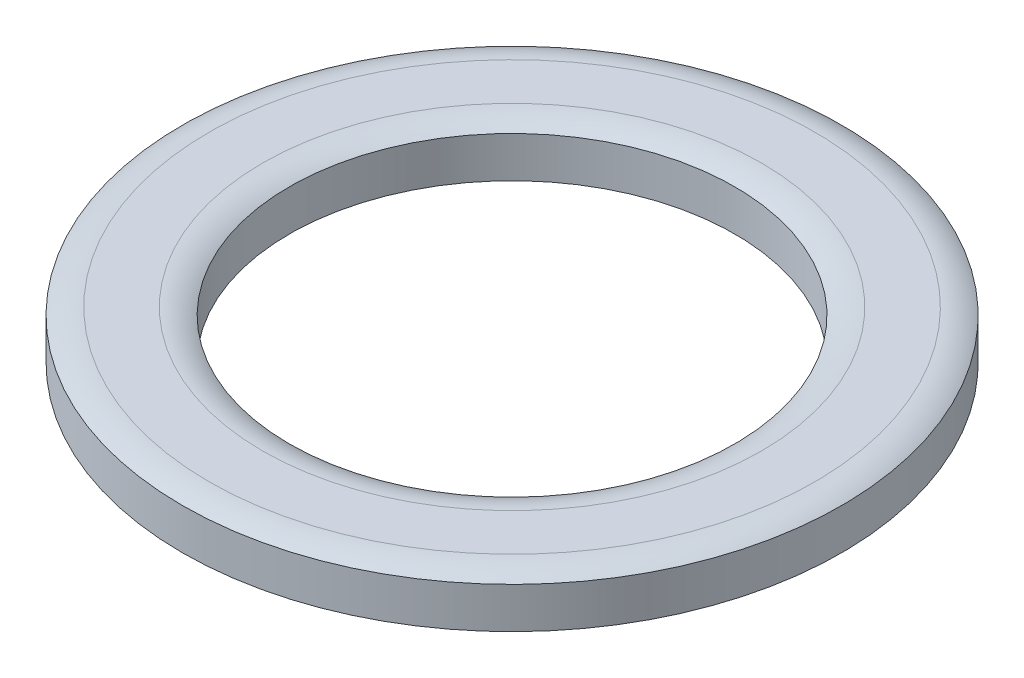
ISO-10303-21;
HEADER;
FILE_DESCRIPTION(('STEP AP214'),'2;1');
FILE_NAME('part.step','',(''),(''),'','','');
FILE_SCHEMA(('AUTOMOTIVE_DESIGN { 1 0 10303 214 1 1 1 1 }'));
ENDSEC;
DATA;
#1=APPLICATION_CONTEXT('core data for automotive mechanical design processes');
#2=APPLICATION_PROTOCOL_DEFINITION('international standard','automotive_design',2000,#1);
#3=PRODUCT_CONTEXT('',#1,'mechanical');
#4=PRODUCT('Part','Part','',(#3));
#5=PRODUCT_RELATED_PRODUCT_CATEGORY('part','',(#4));
#6=PRODUCT_DEFINITION_FORMATION('','',#4);
#7=PRODUCT_DEFINITION_CONTEXT('part definition',#1,'design');
#8=PRODUCT_DEFINITION('design','',#6,#7);
#9=PRODUCT_DEFINITION_SHAPE('','',#8);
#10=(LENGTH_UNIT() NAMED_UNIT(*) SI_UNIT(.MILLI.,.METRE.));
#11=(NAMED_UNIT(*) PLANE_ANGLE_UNIT() SI_UNIT($,.RADIAN.));
#12=(NAMED_UNIT(*) SI_UNIT($,.STERADIAN.) SOLID_ANGLE_UNIT());
#13=UNCERTAINTY_MEASURE_WITH_UNIT(LENGTH_MEASURE(1.E-05),#10,'distance_accuracy_value','');
#14=(GEOMETRIC_REPRESENTATION_CONTEXT(3) GLOBAL_UNCERTAINTY_ASSIGNED_CONTEXT((#13)) GLOBAL_UNIT_ASSIGNED_CONTEXT((#10,
#11,#12)) REPRESENTATION_CONTEXT('',''));
#15=CARTESIAN_POINT('',(0.,0.,0.));
#16=DIRECTION('',(0.,0.,1.));
#17=DIRECTION('',(1.,0.,0.));
#18=AXIS2_PLACEMENT_3D('',#15,#16,#17);
#19=CARTESIAN_POINT('',(0.,0.4064,0.));
#20=DIRECTION('',(0.,1.,0.));
#21=DIRECTION('',(0.,0.,1.));
#22=AXIS2_PLACEMENT_3D('',#19,#20,#21);
#23=CYLINDRICAL_SURFACE('',#22,5.5626);
#24=CARTESIAN_POINT('',(0.,0.284479999999998,0.));
#25=DIRECTION('',(0.,1.,0.));
#26=DIRECTION('',(0.,0.,1.));
#27=AXIS2_PLACEMENT_3D('',#24,#25,#26);
#28=CIRCLE('',#27,5.5626);
#29=CARTESIAN_POINT('',(0.,0.284479999999998,5.5626));
#30=VERTEX_POINT('',#29);
#31=EDGE_CURVE('E56',#30,#30,#28,.T.);
#32=ORIENTED_EDGE('',*,*,#31,.F.);
#33=EDGE_LOOP('',(#32));
#34=FACE_BOUND('',#33,.T.);
#35=CARTESIAN_POINT('',(0.,-0.406400000000002,0.));
#36=DIRECTION('',(0.,1.,0.));
#37=DIRECTION('',(0.,0.,1.));
#38=AXIS2_PLACEMENT_3D('',#35,#36,#37);
#39=CIRCLE('',#38,5.5626);
#40=CARTESIAN_POINT('',(0.,-0.406400000000002,5.5626));
#41=VERTEX_POINT('',#40);
#42=EDGE_CURVE('E10',#41,#41,#39,.T.);
#43=ORIENTED_EDGE('',*,*,#42,.T.);
#44=EDGE_LOOP('',(#43));
#45=FACE_BOUND('',#44,.T.);
#46=ADVANCED_FACE('F34',(#34,#45),#23,.T.);
#47=CARTESIAN_POINT('',(0.,-0.406400000000002,-5.5626));
#48=DIRECTION('',(0.,1.,0.));
#49=DIRECTION('',(0.,0.,1.));
#50=AXIS2_PLACEMENT_3D('',#47,#48,#49);
#51=PLANE('',#50);
#52=ORIENTED_EDGE('',*,*,#42,.F.);
#53=EDGE_LOOP('',(#52));
#54=FACE_BOUND('',#53,.T.);
#55=CARTESIAN_POINT('',(0.,-0.406400000000002,0.));
#56=DIRECTION('',(0.,1.,0.));
#57=DIRECTION('',(0.,0.,1.));
#58=AXIS2_PLACEMENT_3D('',#55,#56,#57);
#59=CIRCLE('',#58,3.7592);
#60=CARTESIAN_POINT('',(0.,-0.406400000000002,3.7592));
#61=VERTEX_POINT('',#60);
#62=EDGE_CURVE('E40',#61,#61,#59,.T.);
#63=ORIENTED_EDGE('',*,*,#62,.T.);
#64=EDGE_LOOP('',(#63));
#65=FACE_BOUND('',#64,.T.);
#66=ADVANCED_FACE('F63',(#54,#65),#51,.F.);
#67=CARTESIAN_POINT('',(0.,0.4064,0.));
#68=DIRECTION('',(0.,1.,0.));
#69=DIRECTION('',(0.,0.,1.));
#70=AXIS2_PLACEMENT_3D('',#67,#68,#69);
#71=CYLINDRICAL_SURFACE('',#70,3.7592);
#72=ORIENTED_EDGE('',*,*,#62,.F.);
#73=EDGE_LOOP('',(#72));
#74=FACE_BOUND('',#73,.T.);
#75=CARTESIAN_POINT('',(0.,0.284479999999998,0.));
#76=DIRECTION('',(0.,1.,0.));
#77=DIRECTION('',(0.,0.,1.));
#78=AXIS2_PLACEMENT_3D('',#75,#76,#77);
#79=CIRCLE('',#78,3.7592);
#80=CARTESIAN_POINT('',(0.,0.284479999999998,3.7592));
#81=VERTEX_POINT('',#80);
#82=EDGE_CURVE('E44',#81,#81,#79,.T.);
#83=ORIENTED_EDGE('',*,*,#82,.T.);
#84=EDGE_LOOP('',(#83));
#85=FACE_BOUND('',#84,.T.);
#86=ADVANCED_FACE('F67',(#74,#85),#71,.F.);
#87=CARTESIAN_POINT('',(0.,-0.488162864583332,0.));
#88=DIRECTION('',(0.,1.,0.));
#89=DIRECTION('',(0.,0.,1.));
#90=AXIS2_PLACEMENT_3D('',#87,#88,#89);
#91=TOROIDAL_SURFACE('',#90,4.21005,0.89456286458333);
#92=ORIENTED_EDGE('',*,*,#82,.F.);
#93=EDGE_LOOP('',(#92));
#94=FACE_BOUND('',#93,.T.);
#95=CARTESIAN_POINT('',(0.,0.406399999999998,0.));
#96=DIRECTION('',(0.,1.,0.));
#97=DIRECTION('',(0.,0.,1.));
#98=AXIS2_PLACEMENT_3D('',#95,#96,#97);
#99=CIRCLE('',#98,4.21005);
#100=CARTESIAN_POINT('',(0.,0.406399999999998,4.21005));
#101=VERTEX_POINT('',#100);
#102=EDGE_CURVE('E48',#101,#101,#99,.T.);
#103=ORIENTED_EDGE('',*,*,#102,.T.);
#104=EDGE_LOOP('',(#103));
#105=FACE_BOUND('',#104,.T.);
#106=ADVANCED_FACE('F72',(#94,#105),#91,.T.);
#107=CARTESIAN_POINT('',(0.,0.406399999999998,-4.21005));
#108=DIRECTION('',(0.,-1.,0.));
#109=DIRECTION('',(0.,0.,-1.));
#110=AXIS2_PLACEMENT_3D('',#107,#108,#109);
#111=PLANE('',#110);
#112=ORIENTED_EDGE('',*,*,#102,.F.);
#113=EDGE_LOOP('',(#112));
#114=FACE_BOUND('',#113,.T.);
#115=CARTESIAN_POINT('',(0.,0.406399999999998,0.));
#116=DIRECTION('',(0.,1.,0.));
#117=DIRECTION('',(0.,0.,1.));
#118=AXIS2_PLACEMENT_3D('',#115,#116,#117);
#119=CIRCLE('',#118,5.11175);
#120=CARTESIAN_POINT('',(0.,0.406399999999998,5.11175));
#121=VERTEX_POINT('',#120);
#122=EDGE_CURVE('E53',#121,#121,#119,.T.);
#123=ORIENTED_EDGE('',*,*,#122,.T.);
#124=EDGE_LOOP('',(#123));
#125=FACE_BOUND('',#124,.T.);
#126=ADVANCED_FACE('F78',(#114,#125),#111,.F.);
#127=CARTESIAN_POINT('',(0.,-0.488162864583332,0.));
#128=DIRECTION('',(0.,1.,0.));
#129=DIRECTION('',(0.,0.,1.));
#130=AXIS2_PLACEMENT_3D('',#127,#128,#129);
#131=TOROIDAL_SURFACE('',#130,5.11175,0.89456286458333);
#132=ORIENTED_EDGE('',*,*,#122,.F.);
#133=EDGE_LOOP('',(#132));
#134=FACE_BOUND('',#133,.T.);
#135=ORIENTED_EDGE('',*,*,#31,.T.);
#136=EDGE_LOOP('',(#135));
#137=FACE_BOUND('',#136,.T.);
#138=ADVANCED_FACE('F60',(#134,#137),#131,.T.);
#139=CLOSED_SHELL('',(#46,#66,#86,#106,#126,#138));
#140=MANIFOLD_SOLID_BREP('B2',#139);
#141=ADVANCED_BREP_SHAPE_REPRESENTATION('',(#18,#140),#14);
#142=SHAPE_DEFINITION_REPRESENTATION(#9,#141);
ENDSEC;
END-ISO-10303-21;
